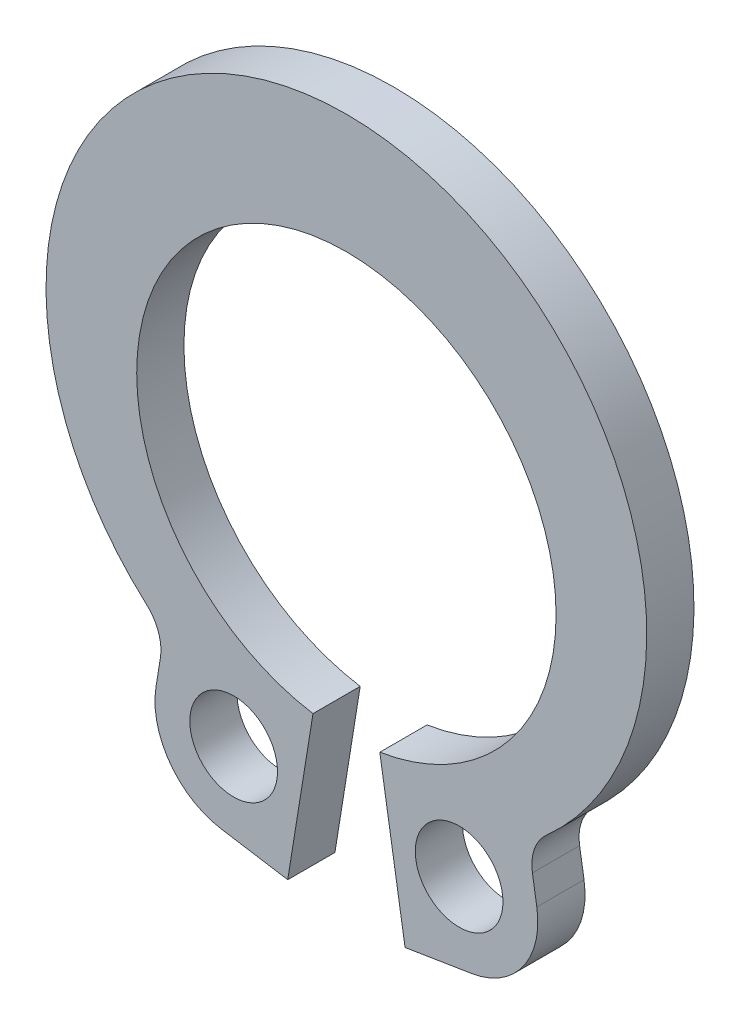
ISO-10303-21;
HEADER;
FILE_DESCRIPTION(('STEP AP214'),'2;1');
FILE_NAME('part.step','',(''),(''),'','','');
FILE_SCHEMA(('AUTOMOTIVE_DESIGN { 1 0 10303 214 1 1 1 1 }'));
ENDSEC;
DATA;
#1=APPLICATION_CONTEXT('core data for automotive mechanical design processes');
#2=APPLICATION_PROTOCOL_DEFINITION('international standard','automotive_design',2000,#1);
#3=PRODUCT_CONTEXT('',#1,'mechanical');
#4=PRODUCT('Part','Part','',(#3));
#5=PRODUCT_RELATED_PRODUCT_CATEGORY('part','',(#4));
#6=PRODUCT_DEFINITION_FORMATION('','',#4);
#7=PRODUCT_DEFINITION_CONTEXT('part definition',#1,'design');
#8=PRODUCT_DEFINITION('design','',#6,#7);
#9=PRODUCT_DEFINITION_SHAPE('','',#8);
#10=(LENGTH_UNIT() NAMED_UNIT(*) SI_UNIT(.MILLI.,.METRE.));
#11=(NAMED_UNIT(*) PLANE_ANGLE_UNIT() SI_UNIT($,.RADIAN.));
#12=(NAMED_UNIT(*) SI_UNIT($,.STERADIAN.) SOLID_ANGLE_UNIT());
#13=UNCERTAINTY_MEASURE_WITH_UNIT(LENGTH_MEASURE(1.E-05),#10,'distance_accuracy_value','');
#14=(GEOMETRIC_REPRESENTATION_CONTEXT(3) GLOBAL_UNCERTAINTY_ASSIGNED_CONTEXT((#13)) GLOBAL_UNIT_ASSIGNED_CONTEXT((#10,
#11,#12)) REPRESENTATION_CONTEXT('',''));
#15=CARTESIAN_POINT('',(0.,0.,0.));
#16=DIRECTION('',(0.,0.,1.));
#17=DIRECTION('',(1.,0.,0.));
#18=AXIS2_PLACEMENT_3D('',#15,#16,#17);
#19=CARTESIAN_POINT('',(0.,0.,-1.0668));
#20=DIRECTION('',(0.,0.,1.));
#21=DIRECTION('',(1.,0.,0.));
#22=AXIS2_PLACEMENT_3D('',#19,#20,#21);
#23=CYLINDRICAL_SURFACE('',#22,4.7371);
#24=CARTESIAN_POINT('',(0.,0.,0.));
#25=DIRECTION('',(0.,0.,-1.));
#26=DIRECTION('',(1.,0.,0.));
#27=AXIS2_PLACEMENT_3D('',#24,#25,#26);
#28=CIRCLE('',#27,4.7371);
#29=CARTESIAN_POINT('',(-0.754834919199653,-4.67657360198221,0.));
#30=VERTEX_POINT('',#29);
#31=CARTESIAN_POINT('',(0.754834919199653,-4.67657360198221,0.));
#32=VERTEX_POINT('',#31);
#33=EDGE_CURVE('E154',#30,#32,#28,.T.);
#34=ORIENTED_EDGE('',*,*,#33,.F.);
#35=DIRECTION('',(0.,0.,1.));
#36=VECTOR('',#35,1.);
#37=CARTESIAN_POINT('',(-0.754834919199653,-4.67657360198221,-1.0668));
#38=LINE('',#37,#36);
#39=CARTESIAN_POINT('',(-0.754834919199653,-4.67657360198221,-1.0668));
#40=VERTEX_POINT('',#39);
#41=EDGE_CURVE('E11',#40,#30,#38,.T.);
#42=ORIENTED_EDGE('',*,*,#41,.F.);
#43=CARTESIAN_POINT('',(0.,0.,-1.0668));
#44=DIRECTION('',(0.,0.,-1.));
#45=DIRECTION('',(1.,0.,0.));
#46=AXIS2_PLACEMENT_3D('',#43,#44,#45);
#47=CIRCLE('',#46,4.7371);
#48=CARTESIAN_POINT('',(0.754834919199653,-4.67657360198221,-1.0668));
#49=VERTEX_POINT('',#48);
#50=EDGE_CURVE('E187',#40,#49,#47,.T.);
#51=ORIENTED_EDGE('',*,*,#50,.T.);
#52=DIRECTION('',(0.,0.,1.));
#53=VECTOR('',#52,1.);
#54=CARTESIAN_POINT('',(0.754834919199653,-4.67657360198221,-1.0668));
#55=LINE('',#54,#53);
#56=EDGE_CURVE('E36',#49,#32,#55,.T.);
#57=ORIENTED_EDGE('',*,*,#56,.T.);
#58=EDGE_LOOP('',(#34,#42,#51,#57));
#59=FACE_BOUND('',#58,.T.);
#60=ADVANCED_FACE('F33',(#59),#23,.F.);
#61=CARTESIAN_POINT('',(-0.754834919199653,-4.67657360198221,-1.0668));
#62=DIRECTION('',(0.987222900504994,-0.15934536302794,0.));
#63=DIRECTION('',(0.15934536302794,0.987222900504994,0.));
#64=AXIS2_PLACEMENT_3D('',#61,#62,#63);
#65=PLANE('',#64);
#66=DIRECTION('',(0.15934536302794,0.987222900504995,0.));
#67=VECTOR('',#66,1.);
#68=CARTESIAN_POINT('',(-0.754834919199653,-4.67657360198221,0.));
#69=LINE('',#68,#67);
#70=CARTESIAN_POINT('',(-1.32551440234792,-8.21221369785079,0.));
#71=VERTEX_POINT('',#70);
#72=EDGE_CURVE('E185',#71,#30,#69,.T.);
#73=ORIENTED_EDGE('',*,*,#72,.F.);
#74=DIRECTION('',(0.,0.,1.));
#75=VECTOR('',#74,1.);
#76=CARTESIAN_POINT('',(-1.32551440234792,-8.21221369785079,-1.0668));
#77=LINE('',#76,#75);
#78=CARTESIAN_POINT('',(-1.32551440234792,-8.21221369785079,-1.0668));
#79=VERTEX_POINT('',#78);
#80=EDGE_CURVE('E42',#79,#71,#77,.T.);
#81=ORIENTED_EDGE('',*,*,#80,.F.);
#82=DIRECTION('',(0.15934536302794,0.987222900504995,0.));
#83=VECTOR('',#82,1.);
#84=CARTESIAN_POINT('',(-0.754834919199653,-4.67657360198221,-1.0668));
#85=LINE('',#84,#83);
#86=EDGE_CURVE('E144',#79,#40,#85,.T.);
#87=ORIENTED_EDGE('',*,*,#86,.T.);
#88=ORIENTED_EDGE('',*,*,#41,.T.);
#89=EDGE_LOOP('',(#73,#81,#87,#88));
#90=FACE_BOUND('',#89,.T.);
#91=ADVANCED_FACE('F207',(#90),#65,.T.);
#92=CARTESIAN_POINT('',(-1.32551440234792,-8.21221369785079,-1.0668));
#93=DIRECTION('',(-0.15934536302794,-0.987222900504994,0.));
#94=DIRECTION('',(0.987222900504994,-0.15934536302794,0.));
#95=AXIS2_PLACEMENT_3D('',#92,#93,#94);
#96=PLANE('',#95);
#97=DIRECTION('',(0.987222900504994,-0.15934536302794,0.));
#98=VECTOR('',#97,1.);
#99=CARTESIAN_POINT('',(-1.32551440234792,-8.21221369785079,0.));
#100=LINE('',#99,#98);
#101=CARTESIAN_POINT('',(-2.83004210271753,-7.96937136459621,0.));
#102=VERTEX_POINT('',#101);
#103=EDGE_CURVE('E131',#102,#71,#100,.T.);
#104=ORIENTED_EDGE('',*,*,#103,.F.);
#105=DIRECTION('',(0.,0.,1.));
#106=VECTOR('',#105,1.);
#107=CARTESIAN_POINT('',(-2.83004210271753,-7.96937136459621,-1.0668));
#108=LINE('',#107,#106);
#109=CARTESIAN_POINT('',(-2.83004210271753,-7.96937136459621,-1.0668));
#110=VERTEX_POINT('',#109);
#111=EDGE_CURVE('E126',#110,#102,#108,.T.);
#112=ORIENTED_EDGE('',*,*,#111,.F.);
#113=DIRECTION('',(0.987222900504994,-0.15934536302794,0.));
#114=VECTOR('',#113,1.);
#115=CARTESIAN_POINT('',(-1.32551440234792,-8.21221369785079,-1.0668));
#116=LINE('',#115,#114);
#117=EDGE_CURVE('E129',#110,#79,#116,.T.);
#118=ORIENTED_EDGE('',*,*,#117,.T.);
#119=ORIENTED_EDGE('',*,*,#80,.T.);
#120=EDGE_LOOP('',(#104,#112,#118,#119));
#121=FACE_BOUND('',#120,.T.);
#122=ADVANCED_FACE('F128',(#121),#96,.T.);
#123=CARTESIAN_POINT('',(-2.54672604725385,-6.21408904749834,-1.0668));
#124=DIRECTION('',(0.,0.,1.));
#125=DIRECTION('',(1.,0.,0.));
#126=AXIS2_PLACEMENT_3D('',#123,#124,#125);
#127=CYLINDRICAL_SURFACE('',#126,1.778);
#128=CARTESIAN_POINT('',(-2.54672604725385,-6.21408904749834,0.));
#129=DIRECTION('',(0.,0.,1.));
#130=DIRECTION('',(1.,0.,0.));
#131=AXIS2_PLACEMENT_3D('',#128,#129,#130);
#132=CIRCLE('',#131,1.778);
#133=CARTESIAN_POINT('',(-4.30200836435173,-5.93077299203466,0.));
#134=VERTEX_POINT('',#133);
#135=EDGE_CURVE('E182',#134,#102,#132,.T.);
#136=ORIENTED_EDGE('',*,*,#135,.F.);
#137=DIRECTION('',(0.,0.,1.));
#138=VECTOR('',#137,1.);
#139=CARTESIAN_POINT('',(-4.30200836435173,-5.93077299203466,-1.0668));
#140=LINE('',#139,#138);
#141=CARTESIAN_POINT('',(-4.30200836435173,-5.93077299203466,-1.0668));
#142=VERTEX_POINT('',#141);
#143=EDGE_CURVE('E136',#142,#134,#140,.T.);
#144=ORIENTED_EDGE('',*,*,#143,.F.);
#145=CARTESIAN_POINT('',(-2.54672604725385,-6.21408904749834,-1.0668));
#146=DIRECTION('',(0.,0.,1.));
#147=DIRECTION('',(1.,0.,0.));
#148=AXIS2_PLACEMENT_3D('',#145,#146,#147);
#149=CIRCLE('',#148,1.778);
#150=EDGE_CURVE('E142',#142,#110,#149,.T.);
#151=ORIENTED_EDGE('',*,*,#150,.T.);
#152=ORIENTED_EDGE('',*,*,#111,.T.);
#153=EDGE_LOOP('',(#136,#144,#151,#152));
#154=FACE_BOUND('',#153,.T.);
#155=ADVANCED_FACE('F146',(#154),#127,.T.);
#156=CARTESIAN_POINT('',(-4.20237468385291,-5.3134933349367,-1.0668));
#157=DIRECTION('',(-0.987222900504994,0.159345363027939,0.));
#158=DIRECTION('',(-0.159345363027939,-0.987222900504995,0.));
#159=AXIS2_PLACEMENT_3D('',#156,#157,#158);
#160=PLANE('',#159);
#161=DIRECTION('',(-0.159345363027939,-0.987222900504995,0.));
#162=VECTOR('',#161,1.);
#163=CARTESIAN_POINT('',(-4.20237468385291,-5.3134933349367,0.));
#164=LINE('',#163,#162);
#165=CARTESIAN_POINT('',(-4.20237468385291,-5.3134933349367,0.));
#166=VERTEX_POINT('',#165);
#167=EDGE_CURVE('E179',#166,#134,#164,.T.);
#168=ORIENTED_EDGE('',*,*,#167,.F.);
#169=DIRECTION('',(0.,0.,1.));
#170=VECTOR('',#169,1.);
#171=CARTESIAN_POINT('',(-4.20237468385291,-5.3134933349367,-1.0668));
#172=LINE('',#171,#170);
#173=CARTESIAN_POINT('',(-4.20237468385291,-5.3134933349367,-1.0668));
#174=VERTEX_POINT('',#173);
#175=EDGE_CURVE('E191',#174,#166,#172,.T.);
#176=ORIENTED_EDGE('',*,*,#175,.F.);
#177=DIRECTION('',(-0.159345363027939,-0.987222900504995,0.));
#178=VECTOR('',#177,1.);
#179=CARTESIAN_POINT('',(-4.20237468385291,-5.3134933349367,-1.0668));
#180=LINE('',#179,#178);
#181=EDGE_CURVE('E147',#174,#142,#180,.T.);
#182=ORIENTED_EDGE('',*,*,#181,.T.);
#183=ORIENTED_EDGE('',*,*,#143,.T.);
#184=EDGE_LOOP('',(#168,#176,#182,#183));
#185=FACE_BOUND('',#184,.T.);
#186=ADVANCED_FACE('F220',(#185),#160,.T.);
#187=CARTESIAN_POINT('',(-5.18031768909315,-5.15564581832122,-1.0668));
#188=DIRECTION('',(0.,0.,1.));
#189=DIRECTION('',(1.,0.,0.));
#190=AXIS2_PLACEMENT_3D('',#187,#188,#189);
#191=CYLINDRICAL_SURFACE('',#190,0.9906);
#192=CARTESIAN_POINT('',(-5.18031768909315,-5.15564581832122,0.));
#193=DIRECTION('',(0.,0.,-1.));
#194=DIRECTION('',(1.,0.,0.));
#195=AXIS2_PLACEMENT_3D('',#192,#193,#194);
#196=CIRCLE('',#195,0.9906);
#197=CARTESIAN_POINT('',(-4.52040731158555,-4.41685853252255,0.));
#198=VERTEX_POINT('',#197);
#199=EDGE_CURVE('E176',#198,#166,#196,.T.);
#200=ORIENTED_EDGE('',*,*,#199,.F.);
#201=DIRECTION('',(0.,0.,1.));
#202=VECTOR('',#201,1.);
#203=CARTESIAN_POINT('',(-4.52040731158555,-4.41685853252255,-1.0668));
#204=LINE('',#203,#202);
#205=CARTESIAN_POINT('',(-4.52040731158555,-4.41685853252255,-1.0668));
#206=VERTEX_POINT('',#205);
#207=EDGE_CURVE('E193',#206,#198,#204,.T.);
#208=ORIENTED_EDGE('',*,*,#207,.F.);
#209=CARTESIAN_POINT('',(-5.18031768909315,-5.15564581832122,-1.0668));
#210=DIRECTION('',(0.,0.,-1.));
#211=DIRECTION('',(1.,0.,0.));
#212=AXIS2_PLACEMENT_3D('',#209,#210,#211);
#213=CIRCLE('',#212,0.9906);
#214=EDGE_CURVE('E149',#206,#174,#213,.T.);
#215=ORIENTED_EDGE('',*,*,#214,.T.);
#216=ORIENTED_EDGE('',*,*,#175,.T.);
#217=EDGE_LOOP('',(#200,#208,#215,#216));
#218=FACE_BOUND('',#217,.T.);
#219=ADVANCED_FACE('F223',(#218),#191,.F.);
#220=CARTESIAN_POINT('',(0.,0.643858137889665,-1.0668));
#221=DIRECTION('',(0.,0.,1.));
#222=DIRECTION('',(1.,0.,0.));
#223=AXIS2_PLACEMENT_3D('',#220,#221,#222);
#224=CYLINDRICAL_SURFACE('',#223,6.78564186211034);
#225=CARTESIAN_POINT('',(0.,0.643858137889665,0.));
#226=DIRECTION('',(0.,0.,1.));
#227=DIRECTION('',(1.,0.,0.));
#228=AXIS2_PLACEMENT_3D('',#225,#226,#227);
#229=CIRCLE('',#228,6.78564186211034);
#230=CARTESIAN_POINT('',(4.52040731158555,-4.41685853252255,0.));
#231=VERTEX_POINT('',#230);
#232=EDGE_CURVE('E173',#231,#198,#229,.T.);
#233=ORIENTED_EDGE('',*,*,#232,.F.);
#234=DIRECTION('',(0.,0.,1.));
#235=VECTOR('',#234,1.);
#236=CARTESIAN_POINT('',(4.52040731158555,-4.41685853252255,-1.0668));
#237=LINE('',#236,#235);
#238=CARTESIAN_POINT('',(4.52040731158555,-4.41685853252255,-1.0668));
#239=VERTEX_POINT('',#238);
#240=EDGE_CURVE('E195',#239,#231,#237,.T.);
#241=ORIENTED_EDGE('',*,*,#240,.F.);
#242=CARTESIAN_POINT('',(0.,0.643858137889665,-1.0668));
#243=DIRECTION('',(0.,0.,1.));
#244=DIRECTION('',(1.,0.,0.));
#245=AXIS2_PLACEMENT_3D('',#242,#243,#244);
#246=CIRCLE('',#245,6.78564186211034);
#247=EDGE_CURVE('E297',#239,#206,#246,.T.);
#248=ORIENTED_EDGE('',*,*,#247,.T.);
#249=ORIENTED_EDGE('',*,*,#207,.T.);
#250=EDGE_LOOP('',(#233,#241,#248,#249));
#251=FACE_BOUND('',#250,.T.);
#252=ADVANCED_FACE('F227',(#251),#224,.T.);
#253=CARTESIAN_POINT('',(5.18031768909315,-5.15564581832122,-1.0668));
#254=DIRECTION('',(0.,0.,1.));
#255=DIRECTION('',(1.,0.,0.));
#256=AXIS2_PLACEMENT_3D('',#253,#254,#255);
#257=CYLINDRICAL_SURFACE('',#256,0.9906);
#258=CARTESIAN_POINT('',(5.18031768909315,-5.15564581832122,0.));
#259=DIRECTION('',(0.,0.,-1.));
#260=DIRECTION('',(1.,0.,0.));
#261=AXIS2_PLACEMENT_3D('',#258,#259,#260);
#262=CIRCLE('',#261,0.9906);
#263=CARTESIAN_POINT('',(4.20237468385291,-5.3134933349367,0.));
#264=VERTEX_POINT('',#263);
#265=EDGE_CURVE('E170',#264,#231,#262,.T.);
#266=ORIENTED_EDGE('',*,*,#265,.F.);
#267=DIRECTION('',(0.,0.,1.));
#268=VECTOR('',#267,1.);
#269=CARTESIAN_POINT('',(4.20237468385291,-5.3134933349367,-1.0668));
#270=LINE('',#269,#268);
#271=CARTESIAN_POINT('',(4.20237468385291,-5.3134933349367,-1.0668));
#272=VERTEX_POINT('',#271);
#273=EDGE_CURVE('E197',#272,#264,#270,.T.);
#274=ORIENTED_EDGE('',*,*,#273,.F.);
#275=CARTESIAN_POINT('',(5.18031768909315,-5.15564581832122,-1.0668));
#276=DIRECTION('',(0.,0.,-1.));
#277=DIRECTION('',(1.,0.,0.));
#278=AXIS2_PLACEMENT_3D('',#275,#276,#277);
#279=CIRCLE('',#278,0.9906);
#280=EDGE_CURVE('E294',#272,#239,#279,.T.);
#281=ORIENTED_EDGE('',*,*,#280,.T.);
#282=ORIENTED_EDGE('',*,*,#240,.T.);
#283=EDGE_LOOP('',(#266,#274,#281,#282));
#284=FACE_BOUND('',#283,.T.);
#285=ADVANCED_FACE('F231',(#284),#257,.F.);
#286=CARTESIAN_POINT('',(4.20237468385291,-5.3134933349367,-1.0668));
#287=DIRECTION('',(0.987222900504994,0.159345363027939,0.));
#288=DIRECTION('',(-0.159345363027939,0.987222900504995,0.));
#289=AXIS2_PLACEMENT_3D('',#286,#287,#288);
#290=PLANE('',#289);
#291=DIRECTION('',(-0.159345363027939,0.987222900504995,0.));
#292=VECTOR('',#291,1.);
#293=CARTESIAN_POINT('',(4.20237468385291,-5.3134933349367,0.));
#294=LINE('',#293,#292);
#295=CARTESIAN_POINT('',(4.30200836435173,-5.93077299203466,0.));
#296=VERTEX_POINT('',#295);
#297=EDGE_CURVE('E167',#296,#264,#294,.T.);
#298=ORIENTED_EDGE('',*,*,#297,.F.);
#299=DIRECTION('',(0.,0.,1.));
#300=VECTOR('',#299,1.);
#301=CARTESIAN_POINT('',(4.30200836435173,-5.93077299203466,-1.0668));
#302=LINE('',#301,#300);
#303=CARTESIAN_POINT('',(4.30200836435173,-5.93077299203466,-1.0668));
#304=VERTEX_POINT('',#303);
#305=EDGE_CURVE('E199',#304,#296,#302,.T.);
#306=ORIENTED_EDGE('',*,*,#305,.F.);
#307=DIRECTION('',(-0.159345363027939,0.987222900504995,0.));
#308=VECTOR('',#307,1.);
#309=CARTESIAN_POINT('',(4.20237468385291,-5.3134933349367,-1.0668));
#310=LINE('',#309,#308);
#311=EDGE_CURVE('E291',#304,#272,#310,.T.);
#312=ORIENTED_EDGE('',*,*,#311,.T.);
#313=ORIENTED_EDGE('',*,*,#273,.T.);
#314=EDGE_LOOP('',(#298,#306,#312,#313));
#315=FACE_BOUND('',#314,.T.);
#316=ADVANCED_FACE('F235',(#315),#290,.T.);
#317=CARTESIAN_POINT('',(2.54672604725385,-6.21408904749834,-1.0668));
#318=DIRECTION('',(0.,0.,1.));
#319=DIRECTION('',(1.,0.,0.));
#320=AXIS2_PLACEMENT_3D('',#317,#318,#319);
#321=CYLINDRICAL_SURFACE('',#320,1.778);
#322=CARTESIAN_POINT('',(2.54672604725385,-6.21408904749834,0.));
#323=DIRECTION('',(0.,0.,1.));
#324=DIRECTION('',(1.,0.,0.));
#325=AXIS2_PLACEMENT_3D('',#322,#323,#324);
#326=CIRCLE('',#325,1.778);
#327=CARTESIAN_POINT('',(2.83004210271753,-7.96937136459621,0.));
#328=VERTEX_POINT('',#327);
#329=EDGE_CURVE('E164',#328,#296,#326,.T.);
#330=ORIENTED_EDGE('',*,*,#329,.F.);
#331=DIRECTION('',(0.,0.,1.));
#332=VECTOR('',#331,1.);
#333=CARTESIAN_POINT('',(2.83004210271753,-7.96937136459621,-1.0668));
#334=LINE('',#333,#332);
#335=CARTESIAN_POINT('',(2.83004210271753,-7.96937136459621,-1.0668));
#336=VERTEX_POINT('',#335);
#337=EDGE_CURVE('E201',#336,#328,#334,.T.);
#338=ORIENTED_EDGE('',*,*,#337,.F.);
#339=CARTESIAN_POINT('',(2.54672604725385,-6.21408904749834,-1.0668));
#340=DIRECTION('',(0.,0.,1.));
#341=DIRECTION('',(1.,0.,0.));
#342=AXIS2_PLACEMENT_3D('',#339,#340,#341);
#343=CIRCLE('',#342,1.778);
#344=EDGE_CURVE('E288',#336,#304,#343,.T.);
#345=ORIENTED_EDGE('',*,*,#344,.T.);
#346=ORIENTED_EDGE('',*,*,#305,.T.);
#347=EDGE_LOOP('',(#330,#338,#345,#346));
#348=FACE_BOUND('',#347,.T.);
#349=ADVANCED_FACE('F239',(#348),#321,.T.);
#350=CARTESIAN_POINT('',(1.32551440234792,-8.21221369785079,-1.0668));
#351=DIRECTION('',(0.15934536302794,-0.987222900504994,0.));
#352=DIRECTION('',(0.987222900504994,0.15934536302794,0.));
#353=AXIS2_PLACEMENT_3D('',#350,#351,#352);
#354=PLANE('',#353);
#355=DIRECTION('',(0.987222900504994,0.15934536302794,0.));
#356=VECTOR('',#355,1.);
#357=CARTESIAN_POINT('',(1.32551440234792,-8.21221369785079,0.));
#358=LINE('',#357,#356);
#359=CARTESIAN_POINT('',(1.32551440234792,-8.21221369785079,0.));
#360=VERTEX_POINT('',#359);
#361=EDGE_CURVE('E161',#360,#328,#358,.T.);
#362=ORIENTED_EDGE('',*,*,#361,.F.);
#363=DIRECTION('',(0.,0.,1.));
#364=VECTOR('',#363,1.);
#365=CARTESIAN_POINT('',(1.32551440234792,-8.21221369785079,-1.0668));
#366=LINE('',#365,#364);
#367=CARTESIAN_POINT('',(1.32551440234792,-8.21221369785079,-1.0668));
#368=VERTEX_POINT('',#367);
#369=EDGE_CURVE('E202',#368,#360,#366,.T.);
#370=ORIENTED_EDGE('',*,*,#369,.F.);
#371=DIRECTION('',(0.987222900504994,0.15934536302794,0.));
#372=VECTOR('',#371,1.);
#373=CARTESIAN_POINT('',(1.32551440234792,-8.21221369785079,-1.0668));
#374=LINE('',#373,#372);
#375=EDGE_CURVE('E285',#368,#336,#374,.T.);
#376=ORIENTED_EDGE('',*,*,#375,.T.);
#377=ORIENTED_EDGE('',*,*,#337,.T.);
#378=EDGE_LOOP('',(#362,#370,#376,#377));
#379=FACE_BOUND('',#378,.T.);
#380=ADVANCED_FACE('F243',(#379),#354,.T.);
#381=CARTESIAN_POINT('',(0.754834919199653,-4.67657360198221,-1.0668));
#382=DIRECTION('',(-0.987222900504994,-0.15934536302794,0.));
#383=DIRECTION('',(0.15934536302794,-0.987222900504994,0.));
#384=AXIS2_PLACEMENT_3D('',#381,#382,#383);
#385=PLANE('',#384);
#386=DIRECTION('',(0.15934536302794,-0.987222900504995,0.));
#387=VECTOR('',#386,1.);
#388=CARTESIAN_POINT('',(0.754834919199653,-4.67657360198221,0.));
#389=LINE('',#388,#387);
#390=EDGE_CURVE('E157',#32,#360,#389,.T.);
#391=ORIENTED_EDGE('',*,*,#390,.F.);
#392=ORIENTED_EDGE('',*,*,#56,.F.);
#393=DIRECTION('',(0.15934536302794,-0.987222900504995,0.));
#394=VECTOR('',#393,1.);
#395=CARTESIAN_POINT('',(0.754834919199653,-4.67657360198221,-1.0668));
#396=LINE('',#395,#394);
#397=EDGE_CURVE('E283',#49,#368,#396,.T.);
#398=ORIENTED_EDGE('',*,*,#397,.T.);
#399=ORIENTED_EDGE('',*,*,#369,.T.);
#400=EDGE_LOOP('',(#391,#392,#398,#399));
#401=FACE_BOUND('',#400,.T.);
#402=ADVANCED_FACE('F204',(#401),#385,.T.);
#403=CARTESIAN_POINT('',(0.,0.,-1.0668));
#404=DIRECTION('',(0.,0.,1.));
#405=DIRECTION('',(1.,0.,0.));
#406=AXIS2_PLACEMENT_3D('',#403,#404,#405);
#407=PLANE('',#406);
#408=CARTESIAN_POINT('',(-2.54672604725385,-6.21408904749834,-1.0668));
#409=DIRECTION('',(0.,0.,1.));
#410=DIRECTION('',(1.,0.,0.));
#411=AXIS2_PLACEMENT_3D('',#408,#409,#410);
#412=CIRCLE('',#411,0.9906);
#413=CARTESIAN_POINT('',(-1.55612604725385,-6.21408904749834,-1.0668));
#414=VERTEX_POINT('',#413);
#415=EDGE_CURVE('E270',#414,#414,#412,.T.);
#416=ORIENTED_EDGE('',*,*,#415,.T.);
#417=EDGE_LOOP('',(#416));
#418=FACE_BOUND('',#417,.T.);
#419=CARTESIAN_POINT('',(2.54672604725385,-6.21408904749833,-1.0668));
#420=DIRECTION('',(0.,0.,1.));
#421=DIRECTION('',(1.,0.,0.));
#422=AXIS2_PLACEMENT_3D('',#419,#420,#421);
#423=CIRCLE('',#422,0.9906);
#424=CARTESIAN_POINT('',(3.53732604725385,-6.21408904749833,-1.0668));
#425=VERTEX_POINT('',#424);
#426=EDGE_CURVE('E158',#425,#425,#423,.T.);
#427=ORIENTED_EDGE('',*,*,#426,.T.);
#428=EDGE_LOOP('',(#427));
#429=FACE_BOUND('',#428,.T.);
#430=ORIENTED_EDGE('',*,*,#50,.F.);
#431=ORIENTED_EDGE('',*,*,#86,.F.);
#432=ORIENTED_EDGE('',*,*,#117,.F.);
#433=ORIENTED_EDGE('',*,*,#150,.F.);
#434=ORIENTED_EDGE('',*,*,#181,.F.);
#435=ORIENTED_EDGE('',*,*,#214,.F.);
#436=ORIENTED_EDGE('',*,*,#247,.F.);
#437=ORIENTED_EDGE('',*,*,#280,.F.);
#438=ORIENTED_EDGE('',*,*,#311,.F.);
#439=ORIENTED_EDGE('',*,*,#344,.F.);
#440=ORIENTED_EDGE('',*,*,#375,.F.);
#441=ORIENTED_EDGE('',*,*,#397,.F.);
#442=EDGE_LOOP('',(#430,#431,#432,#433,#434,#435,#436,#437,#438,#439,#440,#441));
#443=FACE_BOUND('',#442,.T.);
#444=ADVANCED_FACE('F140',(#418,#429,#443),#407,.F.);
#445=CARTESIAN_POINT('',(0.,0.,0.));
#446=DIRECTION('',(0.,0.,1.));
#447=DIRECTION('',(1.,0.,0.));
#448=AXIS2_PLACEMENT_3D('',#445,#446,#447);
#449=PLANE('',#448);
#450=CARTESIAN_POINT('',(-2.54672604725385,-6.21408904749834,0.));
#451=DIRECTION('',(0.,0.,1.));
#452=DIRECTION('',(1.,0.,0.));
#453=AXIS2_PLACEMENT_3D('',#450,#451,#452);
#454=CIRCLE('',#453,0.9906);
#455=CARTESIAN_POINT('',(-1.55612604725385,-6.21408904749834,0.));
#456=VERTEX_POINT('',#455);
#457=EDGE_CURVE('E273',#456,#456,#454,.T.);
#458=ORIENTED_EDGE('',*,*,#457,.F.);
#459=EDGE_LOOP('',(#458));
#460=FACE_BOUND('',#459,.T.);
#461=CARTESIAN_POINT('',(2.54672604725385,-6.21408904749833,0.));
#462=DIRECTION('',(0.,0.,1.));
#463=DIRECTION('',(1.,0.,0.));
#464=AXIS2_PLACEMENT_3D('',#461,#462,#463);
#465=CIRCLE('',#464,0.9906);
#466=CARTESIAN_POINT('',(3.53732604725385,-6.21408904749833,0.));
#467=VERTEX_POINT('',#466);
#468=EDGE_CURVE('E275',#467,#467,#465,.T.);
#469=ORIENTED_EDGE('',*,*,#468,.F.);
#470=EDGE_LOOP('',(#469));
#471=FACE_BOUND('',#470,.T.);
#472=ORIENTED_EDGE('',*,*,#33,.T.);
#473=ORIENTED_EDGE('',*,*,#390,.T.);
#474=ORIENTED_EDGE('',*,*,#361,.T.);
#475=ORIENTED_EDGE('',*,*,#329,.T.);
#476=ORIENTED_EDGE('',*,*,#297,.T.);
#477=ORIENTED_EDGE('',*,*,#265,.T.);
#478=ORIENTED_EDGE('',*,*,#232,.T.);
#479=ORIENTED_EDGE('',*,*,#199,.T.);
#480=ORIENTED_EDGE('',*,*,#167,.T.);
#481=ORIENTED_EDGE('',*,*,#135,.T.);
#482=ORIENTED_EDGE('',*,*,#103,.T.);
#483=ORIENTED_EDGE('',*,*,#72,.T.);
#484=EDGE_LOOP('',(#472,#473,#474,#475,#476,#477,#478,#479,#480,#481,#482,#483));
#485=FACE_BOUND('',#484,.T.);
#486=ADVANCED_FACE('F206',(#460,#471,#485),#449,.T.);
#487=CARTESIAN_POINT('',(2.54672604725385,-6.21408904749833,-1.0668));
#488=DIRECTION('',(0.,0.,1.));
#489=DIRECTION('',(1.,0.,0.));
#490=AXIS2_PLACEMENT_3D('',#487,#488,#489);
#491=CYLINDRICAL_SURFACE('',#490,0.9906);
#492=ORIENTED_EDGE('',*,*,#426,.F.);
#493=EDGE_LOOP('',(#492));
#494=FACE_BOUND('',#493,.T.);
#495=ORIENTED_EDGE('',*,*,#468,.T.);
#496=EDGE_LOOP('',(#495));
#497=FACE_BOUND('',#496,.T.);
#498=ADVANCED_FACE('F255',(#494,#497),#491,.F.);
#499=CARTESIAN_POINT('',(-2.54672604725385,-6.21408904749834,-1.0668));
#500=DIRECTION('',(0.,0.,1.));
#501=DIRECTION('',(1.,0.,0.));
#502=AXIS2_PLACEMENT_3D('',#499,#500,#501);
#503=CYLINDRICAL_SURFACE('',#502,0.9906);
#504=ORIENTED_EDGE('',*,*,#415,.F.);
#505=EDGE_LOOP('',(#504));
#506=FACE_BOUND('',#505,.T.);
#507=ORIENTED_EDGE('',*,*,#457,.T.);
#508=EDGE_LOOP('',(#507));
#509=FACE_BOUND('',#508,.T.);
#510=ADVANCED_FACE('F262',(#506,#509),#503,.F.);
#511=CLOSED_SHELL('',(#60,#91,#122,#155,#186,#219,#252,#285,#316,#349,#380,#402,#444,#486,#498,#510));
#512=MANIFOLD_SOLID_BREP('B2',#511);
#513=ADVANCED_BREP_SHAPE_REPRESENTATION('',(#18,#512),#14);
#514=SHAPE_DEFINITION_REPRESENTATION(#9,#513);
ENDSEC;
END-ISO-10303-21;
